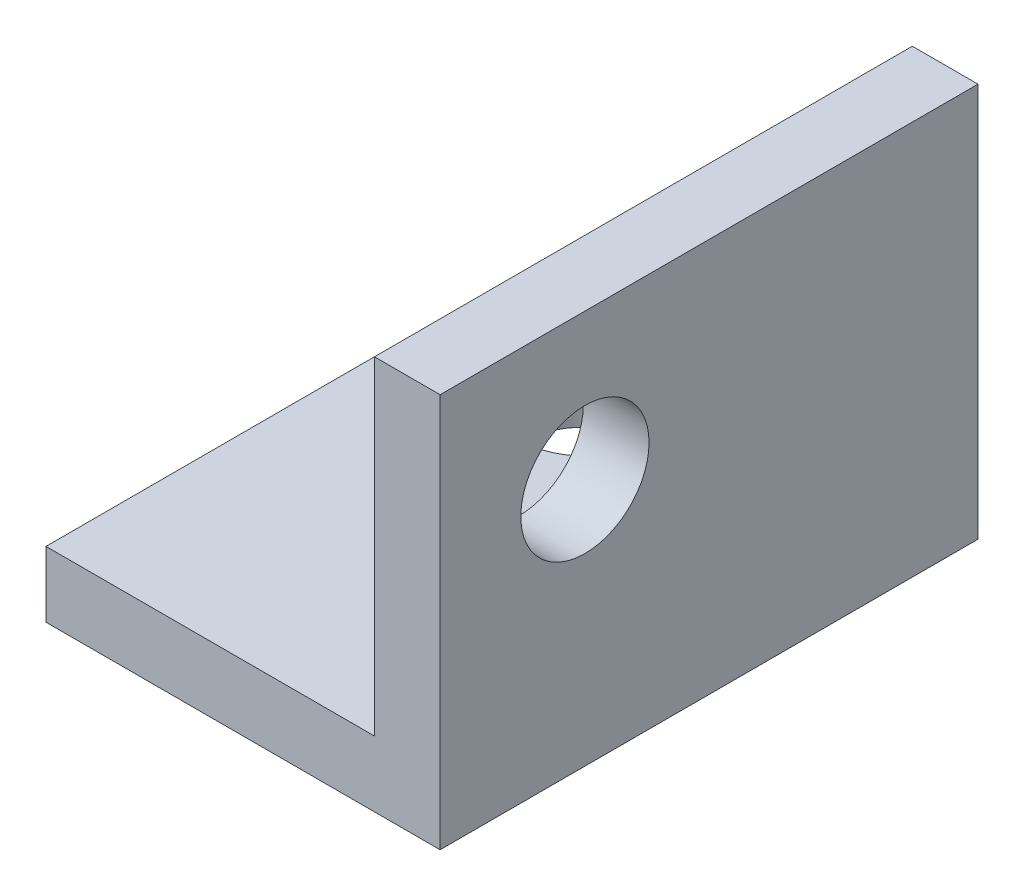
ISO-10303-21;
HEADER;
FILE_DESCRIPTION(('STEP AP214'),'2;1');
FILE_NAME('part.step','',(''),(''),'','','');
FILE_SCHEMA(('AUTOMOTIVE_DESIGN { 1 0 10303 214 1 1 1 1 }'));
ENDSEC;
DATA;
#1=APPLICATION_CONTEXT('core data for automotive mechanical design processes');
#2=APPLICATION_PROTOCOL_DEFINITION('international standard','automotive_design',2000,#1);
#3=PRODUCT_CONTEXT('',#1,'mechanical');
#4=PRODUCT('Part','Part','',(#3));
#5=PRODUCT_RELATED_PRODUCT_CATEGORY('part','',(#4));
#6=PRODUCT_DEFINITION_FORMATION('','',#4);
#7=PRODUCT_DEFINITION_CONTEXT('part definition',#1,'design');
#8=PRODUCT_DEFINITION('design','',#6,#7);
#9=PRODUCT_DEFINITION_SHAPE('','',#8);
#10=(LENGTH_UNIT() NAMED_UNIT(*) SI_UNIT(.MILLI.,.METRE.));
#11=(NAMED_UNIT(*) PLANE_ANGLE_UNIT() SI_UNIT($,.RADIAN.));
#12=(NAMED_UNIT(*) SI_UNIT($,.STERADIAN.) SOLID_ANGLE_UNIT());
#13=UNCERTAINTY_MEASURE_WITH_UNIT(LENGTH_MEASURE(1.E-05),#10,'distance_accuracy_value','');
#14=(GEOMETRIC_REPRESENTATION_CONTEXT(3) GLOBAL_UNCERTAINTY_ASSIGNED_CONTEXT((#13)) GLOBAL_UNIT_ASSIGNED_CONTEXT((#10,
#11,#12)) REPRESENTATION_CONTEXT('',''));
#15=CARTESIAN_POINT('',(0.,0.,0.));
#16=DIRECTION('',(0.,0.,1.));
#17=DIRECTION('',(1.,0.,0.));
#18=AXIS2_PLACEMENT_3D('',#15,#16,#17);
#19=CARTESIAN_POINT('',(3.175,4.7625,6.5));
#20=DIRECTION('',(1.,0.,0.));
#21=DIRECTION('',(0.,1.,0.));
#22=AXIS2_PLACEMENT_3D('',#19,#20,#21);
#23=PLANE('',#22);
#24=CARTESIAN_POINT('',(3.175,1.2375,3.));
#25=DIRECTION('',(1.,0.,0.));
#26=DIRECTION('',(0.,1.,0.));
#27=AXIS2_PLACEMENT_3D('',#24,#25,#26);
#28=CIRCLE('',#27,1.55);
#29=CARTESIAN_POINT('',(3.175,2.7875,3.));
#30=VERTEX_POINT('',#29);
#31=EDGE_CURVE('E125',#30,#30,#28,.T.);
#32=ORIENTED_EDGE('',*,*,#31,.T.);
#33=EDGE_LOOP('',(#32));
#34=FACE_BOUND('',#33,.T.);
#35=DIRECTION('',(0.,-1.,0.));
#36=VECTOR('',#35,1.);
#37=CARTESIAN_POINT('',(3.175,4.7625,-6.5));
#38=LINE('',#37,#36);
#39=CARTESIAN_POINT('',(3.175,4.7625,-6.5));
#40=VERTEX_POINT('',#39);
#41=CARTESIAN_POINT('',(3.175,-3.175,-6.5));
#42=VERTEX_POINT('',#41);
#43=EDGE_CURVE('E121',#40,#42,#38,.T.);
#44=ORIENTED_EDGE('',*,*,#43,.T.);
#45=DIRECTION('',(0.,0.,-1.));
#46=VECTOR('',#45,1.);
#47=CARTESIAN_POINT('',(3.175,-3.175,6.5));
#48=LINE('',#47,#46);
#49=CARTESIAN_POINT('',(3.175,-3.175,6.5));
#50=VERTEX_POINT('',#49);
#51=EDGE_CURVE('E11',#50,#42,#48,.T.);
#52=ORIENTED_EDGE('',*,*,#51,.F.);
#53=DIRECTION('',(0.,-1.,0.));
#54=VECTOR('',#53,1.);
#55=CARTESIAN_POINT('',(3.175,4.7625,6.5));
#56=LINE('',#55,#54);
#57=CARTESIAN_POINT('',(3.175,4.7625,6.5));
#58=VERTEX_POINT('',#57);
#59=EDGE_CURVE('E132',#58,#50,#56,.T.);
#60=ORIENTED_EDGE('',*,*,#59,.F.);
#61=DIRECTION('',(0.,0.,-1.));
#62=VECTOR('',#61,1.);
#63=CARTESIAN_POINT('',(3.175,4.7625,6.5));
#64=LINE('',#63,#62);
#65=EDGE_CURVE('E117',#58,#40,#64,.T.);
#66=ORIENTED_EDGE('',*,*,#65,.T.);
#67=EDGE_LOOP('',(#44,#52,#60,#66));
#68=FACE_BOUND('',#67,.T.);
#69=ADVANCED_FACE('F37',(#34,#68),#23,.F.);
#70=CARTESIAN_POINT('',(3.175,-3.175,6.5));
#71=DIRECTION('',(0.,-1.,0.));
#72=DIRECTION('',(1.,0.,0.));
#73=AXIS2_PLACEMENT_3D('',#70,#71,#72);
#74=PLANE('',#73);
#75=CARTESIAN_POINT('',(-1.2375,-3.175,-3.));
#76=DIRECTION('',(0.,-1.,0.));
#77=DIRECTION('',(1.,0.,0.));
#78=AXIS2_PLACEMENT_3D('',#75,#76,#77);
#79=CIRCLE('',#78,1.55);
#80=CARTESIAN_POINT('',(0.3125,-3.175,-3.));
#81=VERTEX_POINT('',#80);
#82=EDGE_CURVE('E169',#81,#81,#79,.T.);
#83=ORIENTED_EDGE('',*,*,#82,.T.);
#84=EDGE_LOOP('',(#83));
#85=FACE_BOUND('',#84,.T.);
#86=DIRECTION('',(-1.,0.,0.));
#87=VECTOR('',#86,1.);
#88=CARTESIAN_POINT('',(3.175,-3.175,-6.5));
#89=LINE('',#88,#87);
#90=CARTESIAN_POINT('',(-4.7625,-3.175,-6.5));
#91=VERTEX_POINT('',#90);
#92=EDGE_CURVE('E124',#42,#91,#89,.T.);
#93=ORIENTED_EDGE('',*,*,#92,.T.);
#94=DIRECTION('',(0.,0.,-1.));
#95=VECTOR('',#94,1.);
#96=CARTESIAN_POINT('',(-4.7625,-3.175,6.5));
#97=LINE('',#96,#95);
#98=CARTESIAN_POINT('',(-4.7625,-3.175,6.5));
#99=VERTEX_POINT('',#98);
#100=EDGE_CURVE('E45',#99,#91,#97,.T.);
#101=ORIENTED_EDGE('',*,*,#100,.F.);
#102=DIRECTION('',(-1.,0.,0.));
#103=VECTOR('',#102,1.);
#104=CARTESIAN_POINT('',(3.175,-3.175,6.5));
#105=LINE('',#104,#103);
#106=EDGE_CURVE('E90',#50,#99,#105,.T.);
#107=ORIENTED_EDGE('',*,*,#106,.F.);
#108=ORIENTED_EDGE('',*,*,#51,.T.);
#109=EDGE_LOOP('',(#93,#101,#107,#108));
#110=FACE_BOUND('',#109,.T.);
#111=ADVANCED_FACE('F157',(#85,#110),#74,.F.);
#112=CARTESIAN_POINT('',(-4.7625,-4.7625,6.5));
#113=DIRECTION('',(1.,0.,0.));
#114=DIRECTION('',(0.,0.,-1.));
#115=AXIS2_PLACEMENT_3D('',#112,#113,#114);
#116=PLANE('',#115);
#117=DIRECTION('',(0.,-1.,0.));
#118=VECTOR('',#117,1.);
#119=CARTESIAN_POINT('',(-4.7625,-4.7625,-6.5));
#120=LINE('',#119,#118);
#121=CARTESIAN_POINT('',(-4.7625,-4.7625,-6.5));
#122=VERTEX_POINT('',#121);
#123=EDGE_CURVE('E127',#91,#122,#120,.T.);
#124=ORIENTED_EDGE('',*,*,#123,.T.);
#125=DIRECTION('',(0.,0.,-1.));
#126=VECTOR('',#125,1.);
#127=CARTESIAN_POINT('',(-4.7625,-4.7625,6.5));
#128=LINE('',#127,#126);
#129=CARTESIAN_POINT('',(-4.7625,-4.7625,6.5));
#130=VERTEX_POINT('',#129);
#131=EDGE_CURVE('E112',#130,#122,#128,.T.);
#132=ORIENTED_EDGE('',*,*,#131,.F.);
#133=DIRECTION('',(0.,-1.,0.));
#134=VECTOR('',#133,1.);
#135=CARTESIAN_POINT('',(-4.7625,-4.7625,6.5));
#136=LINE('',#135,#134);
#137=EDGE_CURVE('E103',#99,#130,#136,.T.);
#138=ORIENTED_EDGE('',*,*,#137,.F.);
#139=ORIENTED_EDGE('',*,*,#100,.T.);
#140=EDGE_LOOP('',(#124,#132,#138,#139));
#141=FACE_BOUND('',#140,.T.);
#142=ADVANCED_FACE('F138',(#141),#116,.F.);
#143=CARTESIAN_POINT('',(-4.7625,-4.7625,6.5));
#144=DIRECTION('',(0.,1.,0.));
#145=DIRECTION('',(0.,0.,1.));
#146=AXIS2_PLACEMENT_3D('',#143,#144,#145);
#147=PLANE('',#146);
#148=CARTESIAN_POINT('',(-1.2375,-4.7625,-3.));
#149=DIRECTION('',(0.,-1.,0.));
#150=DIRECTION('',(0.,0.,-1.));
#151=AXIS2_PLACEMENT_3D('',#148,#149,#150);
#152=CIRCLE('',#151,1.55);
#153=CARTESIAN_POINT('',(-1.2375,-4.7625,-4.55));
#154=VERTEX_POINT('',#153);
#155=EDGE_CURVE('E176',#154,#154,#152,.T.);
#156=ORIENTED_EDGE('',*,*,#155,.F.);
#157=EDGE_LOOP('',(#156));
#158=FACE_BOUND('',#157,.T.);
#159=DIRECTION('',(1.,0.,0.));
#160=VECTOR('',#159,1.);
#161=CARTESIAN_POINT('',(-4.7625,-4.7625,-6.5));
#162=LINE('',#161,#160);
#163=CARTESIAN_POINT('',(4.7625,-4.7625,-6.5));
#164=VERTEX_POINT('',#163);
#165=EDGE_CURVE('E111',#122,#164,#162,.T.);
#166=ORIENTED_EDGE('',*,*,#165,.T.);
#167=DIRECTION('',(0.,0.,-1.));
#168=VECTOR('',#167,1.);
#169=CARTESIAN_POINT('',(4.7625,-4.7625,6.5));
#170=LINE('',#169,#168);
#171=CARTESIAN_POINT('',(4.7625,-4.7625,6.5));
#172=VERTEX_POINT('',#171);
#173=EDGE_CURVE('E108',#172,#164,#170,.T.);
#174=ORIENTED_EDGE('',*,*,#173,.F.);
#175=DIRECTION('',(1.,0.,0.));
#176=VECTOR('',#175,1.);
#177=CARTESIAN_POINT('',(-4.7625,-4.7625,6.5));
#178=LINE('',#177,#176);
#179=EDGE_CURVE('E97',#130,#172,#178,.T.);
#180=ORIENTED_EDGE('',*,*,#179,.F.);
#181=ORIENTED_EDGE('',*,*,#131,.T.);
#182=EDGE_LOOP('',(#166,#174,#180,#181));
#183=FACE_BOUND('',#182,.T.);
#184=ADVANCED_FACE('F109',(#158,#183),#147,.F.);
#185=CARTESIAN_POINT('',(4.7625,-4.7625,6.5));
#186=DIRECTION('',(-1.,0.,0.));
#187=DIRECTION('',(0.,0.,1.));
#188=AXIS2_PLACEMENT_3D('',#185,#186,#187);
#189=PLANE('',#188);
#190=CARTESIAN_POINT('',(4.7625,1.2375,3.));
#191=DIRECTION('',(1.,0.,0.));
#192=DIRECTION('',(0.,0.,-1.));
#193=AXIS2_PLACEMENT_3D('',#190,#191,#192);
#194=CIRCLE('',#193,1.55);
#195=CARTESIAN_POINT('',(4.7625,1.2375,1.45));
#196=VERTEX_POINT('',#195);
#197=EDGE_CURVE('E166',#196,#196,#194,.T.);
#198=ORIENTED_EDGE('',*,*,#197,.F.);
#199=EDGE_LOOP('',(#198));
#200=FACE_BOUND('',#199,.T.);
#201=DIRECTION('',(0.,1.,0.));
#202=VECTOR('',#201,1.);
#203=CARTESIAN_POINT('',(4.7625,-4.7625,-6.5));
#204=LINE('',#203,#202);
#205=CARTESIAN_POINT('',(4.7625,4.7625,-6.5));
#206=VERTEX_POINT('',#205);
#207=EDGE_CURVE('E76',#164,#206,#204,.T.);
#208=ORIENTED_EDGE('',*,*,#207,.T.);
#209=DIRECTION('',(0.,0.,-1.));
#210=VECTOR('',#209,1.);
#211=CARTESIAN_POINT('',(4.7625,4.7625,6.5));
#212=LINE('',#211,#210);
#213=CARTESIAN_POINT('',(4.7625,4.7625,6.5));
#214=VERTEX_POINT('',#213);
#215=EDGE_CURVE('E113',#214,#206,#212,.T.);
#216=ORIENTED_EDGE('',*,*,#215,.F.);
#217=DIRECTION('',(0.,1.,0.));
#218=VECTOR('',#217,1.);
#219=CARTESIAN_POINT('',(4.7625,-4.7625,6.5));
#220=LINE('',#219,#218);
#221=EDGE_CURVE('E101',#172,#214,#220,.T.);
#222=ORIENTED_EDGE('',*,*,#221,.F.);
#223=ORIENTED_EDGE('',*,*,#173,.T.);
#224=EDGE_LOOP('',(#208,#216,#222,#223));
#225=FACE_BOUND('',#224,.T.);
#226=ADVANCED_FACE('F115',(#200,#225),#189,.F.);
#227=CARTESIAN_POINT('',(4.7625,4.7625,6.5));
#228=DIRECTION('',(0.,-1.,0.));
#229=DIRECTION('',(1.,0.,0.));
#230=AXIS2_PLACEMENT_3D('',#227,#228,#229);
#231=PLANE('',#230);
#232=DIRECTION('',(-1.,0.,0.));
#233=VECTOR('',#232,1.);
#234=CARTESIAN_POINT('',(4.7625,4.7625,-6.5));
#235=LINE('',#234,#233);
#236=EDGE_CURVE('E82',#206,#40,#235,.T.);
#237=ORIENTED_EDGE('',*,*,#236,.T.);
#238=ORIENTED_EDGE('',*,*,#65,.F.);
#239=DIRECTION('',(-1.,0.,0.));
#240=VECTOR('',#239,1.);
#241=CARTESIAN_POINT('',(4.7625,4.7625,6.5));
#242=LINE('',#241,#240);
#243=EDGE_CURVE('E53',#214,#58,#242,.T.);
#244=ORIENTED_EDGE('',*,*,#243,.F.);
#245=ORIENTED_EDGE('',*,*,#215,.T.);
#246=EDGE_LOOP('',(#237,#238,#244,#245));
#247=FACE_BOUND('',#246,.T.);
#248=ADVANCED_FACE('F145',(#247),#231,.F.);
#249=CARTESIAN_POINT('',(0.,0.,6.5));
#250=DIRECTION('',(0.,0.,-1.));
#251=DIRECTION('',(-1.,0.,0.));
#252=AXIS2_PLACEMENT_3D('',#249,#250,#251);
#253=PLANE('',#252);
#254=ORIENTED_EDGE('',*,*,#59,.T.);
#255=ORIENTED_EDGE('',*,*,#106,.T.);
#256=ORIENTED_EDGE('',*,*,#137,.T.);
#257=ORIENTED_EDGE('',*,*,#179,.T.);
#258=ORIENTED_EDGE('',*,*,#221,.T.);
#259=ORIENTED_EDGE('',*,*,#243,.T.);
#260=EDGE_LOOP('',(#254,#255,#256,#257,#258,#259));
#261=FACE_BOUND('',#260,.T.);
#262=ADVANCED_FACE('F99',(#261),#253,.F.);
#263=CARTESIAN_POINT('',(0.,0.,-6.5));
#264=DIRECTION('',(0.,0.,-1.));
#265=DIRECTION('',(-1.,0.,0.));
#266=AXIS2_PLACEMENT_3D('',#263,#264,#265);
#267=PLANE('',#266);
#268=ORIENTED_EDGE('',*,*,#43,.F.);
#269=ORIENTED_EDGE('',*,*,#236,.F.);
#270=ORIENTED_EDGE('',*,*,#207,.F.);
#271=ORIENTED_EDGE('',*,*,#165,.F.);
#272=ORIENTED_EDGE('',*,*,#123,.F.);
#273=ORIENTED_EDGE('',*,*,#92,.F.);
#274=EDGE_LOOP('',(#268,#269,#270,#271,#272,#273));
#275=FACE_BOUND('',#274,.T.);
#276=ADVANCED_FACE('F141',(#275),#267,.T.);
#277=CARTESIAN_POINT('',(-5.2375,1.2375,3.));
#278=DIRECTION('',(1.,0.,0.));
#279=DIRECTION('',(0.,0.,-1.));
#280=AXIS2_PLACEMENT_3D('',#277,#278,#279);
#281=CYLINDRICAL_SURFACE('',#280,1.55);
#282=ORIENTED_EDGE('',*,*,#197,.T.);
#283=EDGE_LOOP('',(#282));
#284=FACE_BOUND('',#283,.T.);
#285=ORIENTED_EDGE('',*,*,#31,.F.);
#286=EDGE_LOOP('',(#285));
#287=FACE_BOUND('',#286,.T.);
#288=ADVANCED_FACE('F201',(#284,#287),#281,.F.);
#289=CARTESIAN_POINT('',(-1.2375,5.2375,-3.));
#290=DIRECTION('',(0.,-1.,0.));
#291=DIRECTION('',(0.,0.,-1.));
#292=AXIS2_PLACEMENT_3D('',#289,#290,#291);
#293=CYLINDRICAL_SURFACE('',#292,1.55);
#294=ORIENTED_EDGE('',*,*,#155,.T.);
#295=EDGE_LOOP('',(#294));
#296=FACE_BOUND('',#295,.T.);
#297=ORIENTED_EDGE('',*,*,#82,.F.);
#298=EDGE_LOOP('',(#297));
#299=FACE_BOUND('',#298,.T.);
#300=ADVANCED_FACE('F180',(#296,#299),#293,.F.);
#301=CLOSED_SHELL('',(#69,#111,#142,#184,#226,#248,#262,#276,#288,#300));
#302=MANIFOLD_SOLID_BREP('B2',#301);
#303=ADVANCED_BREP_SHAPE_REPRESENTATION('',(#18,#302),#14);
#304=SHAPE_DEFINITION_REPRESENTATION(#9,#303);
ENDSEC;
END-ISO-10303-21;
